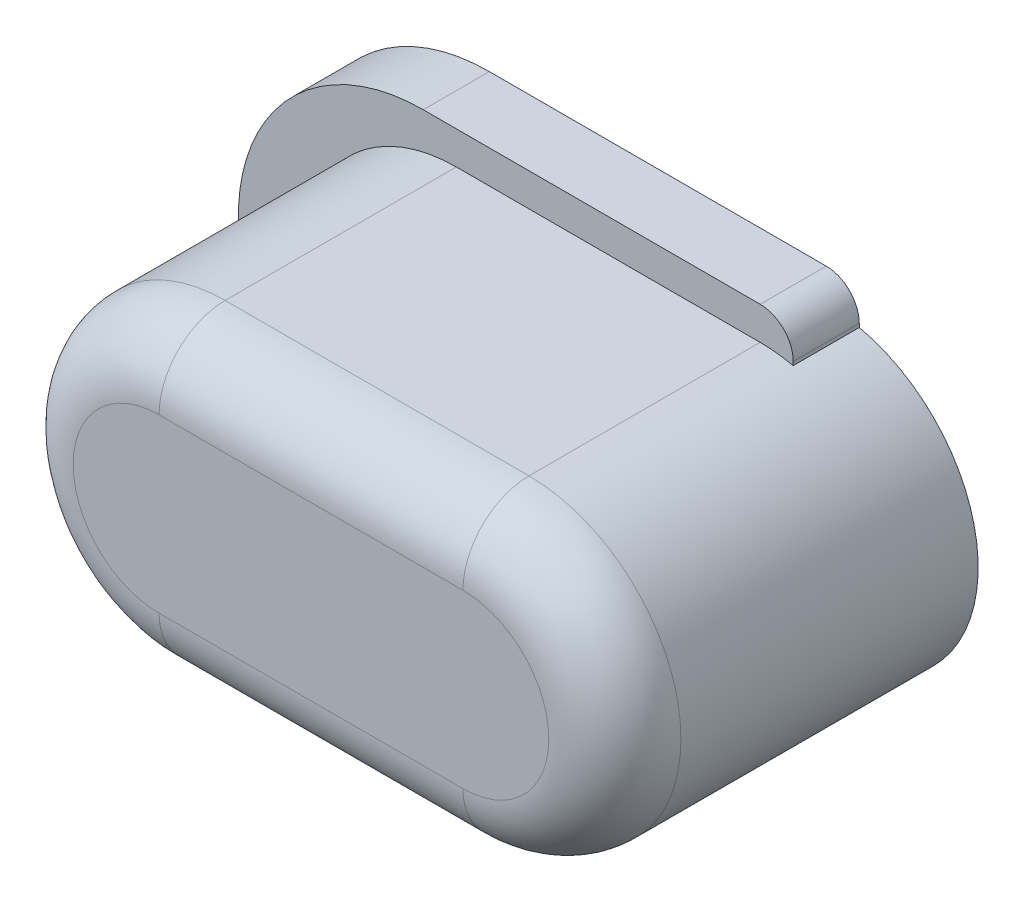
ISO-10303-21;
HEADER;
FILE_DESCRIPTION(('STEP AP214'),'2;1');
FILE_NAME('part.step','',(''),(''),'','','');
FILE_SCHEMA(('AUTOMOTIVE_DESIGN { 1 0 10303 214 1 1 1 1 }'));
ENDSEC;
DATA;
#1=APPLICATION_CONTEXT('core data for automotive mechanical design processes');
#2=APPLICATION_PROTOCOL_DEFINITION('international standard','automotive_design',2000,#1);
#3=PRODUCT_CONTEXT('',#1,'mechanical');
#4=PRODUCT('Part','Part','',(#3));
#5=PRODUCT_RELATED_PRODUCT_CATEGORY('part','',(#4));
#6=PRODUCT_DEFINITION_FORMATION('','',#4);
#7=PRODUCT_DEFINITION_CONTEXT('part definition',#1,'design');
#8=PRODUCT_DEFINITION('design','',#6,#7);
#9=PRODUCT_DEFINITION_SHAPE('','',#8);
#10=(LENGTH_UNIT() NAMED_UNIT(*) SI_UNIT(.MILLI.,.METRE.));
#11=(NAMED_UNIT(*) PLANE_ANGLE_UNIT() SI_UNIT($,.RADIAN.));
#12=(NAMED_UNIT(*) SI_UNIT($,.STERADIAN.) SOLID_ANGLE_UNIT());
#13=UNCERTAINTY_MEASURE_WITH_UNIT(LENGTH_MEASURE(1.E-05),#10,'distance_accuracy_value','');
#14=(GEOMETRIC_REPRESENTATION_CONTEXT(3) GLOBAL_UNCERTAINTY_ASSIGNED_CONTEXT((#13)) GLOBAL_UNIT_ASSIGNED_CONTEXT((#10,
#11,#12)) REPRESENTATION_CONTEXT('',''));
#15=CARTESIAN_POINT('',(0.,0.,0.));
#16=DIRECTION('',(0.,0.,1.));
#17=DIRECTION('',(1.,0.,0.));
#18=AXIS2_PLACEMENT_3D('',#15,#16,#17);
#19=CARTESIAN_POINT('',(2.3,2.3,5.5));
#20=DIRECTION('',(0.,-1.,0.));
#21=DIRECTION('',(1.,0.,0.));
#22=AXIS2_PLACEMENT_3D('',#19,#20,#21);
#23=PLANE('',#22);
#24=DIRECTION('',(0.,0.,-1.));
#25=VECTOR('',#24,1.);
#26=CARTESIAN_POINT('',(-2.3,2.3,5.5));
#27=LINE('',#26,#25);
#28=CARTESIAN_POINT('',(-2.3,2.3,4.5));
#29=VERTEX_POINT('',#28);
#30=CARTESIAN_POINT('',(-2.3,2.3,1.));
#31=VERTEX_POINT('',#30);
#32=EDGE_CURVE('E260',#29,#31,#27,.T.);
#33=ORIENTED_EDGE('',*,*,#32,.F.);
#34=DIRECTION('',(-1.,0.,0.));
#35=VECTOR('',#34,1.);
#36=CARTESIAN_POINT('',(2.3,2.3,4.5));
#37=LINE('',#36,#35);
#38=CARTESIAN_POINT('',(2.3,2.3,4.5));
#39=VERTEX_POINT('',#38);
#40=EDGE_CURVE('E11',#29,#39,#37,.F.);
#41=ORIENTED_EDGE('',*,*,#40,.T.);
#42=DIRECTION('',(0.,0.,-1.));
#43=VECTOR('',#42,1.);
#44=CARTESIAN_POINT('',(2.3,2.3,5.5));
#45=LINE('',#44,#43);
#46=CARTESIAN_POINT('',(2.3,2.3,1.));
#47=VERTEX_POINT('',#46);
#48=EDGE_CURVE('E263',#39,#47,#45,.T.);
#49=ORIENTED_EDGE('',*,*,#48,.T.);
#50=DIRECTION('',(1.,0.,0.));
#51=VECTOR('',#50,1.);
#52=CARTESIAN_POINT('',(2.3,2.3,1.));
#53=LINE('',#52,#51);
#54=EDGE_CURVE('E242',#31,#47,#53,.T.);
#55=ORIENTED_EDGE('',*,*,#54,.F.);
#56=EDGE_LOOP('',(#33,#41,#49,#55));
#57=FACE_BOUND('',#56,.T.);
#58=ADVANCED_FACE('F43',(#57),#23,.F.);
#59=CARTESIAN_POINT('',(-2.3,0.,5.5));
#60=DIRECTION('',(0.,0.,-1.));
#61=DIRECTION('',(-1.,0.,0.));
#62=AXIS2_PLACEMENT_3D('',#59,#60,#61);
#63=CYLINDRICAL_SURFACE('',#62,2.3);
#64=DIRECTION('',(0.,0.,-1.));
#65=VECTOR('',#64,1.);
#66=CARTESIAN_POINT('',(-2.3,-2.3,5.5));
#67=LINE('',#66,#65);
#68=CARTESIAN_POINT('',(-2.3,-2.3,4.5));
#69=VERTEX_POINT('',#68);
#70=CARTESIAN_POINT('',(-2.3,-2.3,1.));
#71=VERTEX_POINT('',#70);
#72=EDGE_CURVE('E257',#69,#71,#67,.T.);
#73=ORIENTED_EDGE('',*,*,#72,.F.);
#74=CARTESIAN_POINT('',(-2.3,0.,4.5));
#75=DIRECTION('',(0.,0.,1.));
#76=DIRECTION('',(1.,0.,0.));
#77=AXIS2_PLACEMENT_3D('',#74,#75,#76);
#78=CIRCLE('',#77,2.3);
#79=EDGE_CURVE('E53',#69,#29,#78,.F.);
#80=ORIENTED_EDGE('',*,*,#79,.T.);
#81=ORIENTED_EDGE('',*,*,#32,.T.);
#82=CARTESIAN_POINT('',(-2.3,0.,1.));
#83=DIRECTION('',(0.,0.,-1.));
#84=DIRECTION('',(-1.,0.,0.));
#85=AXIS2_PLACEMENT_3D('',#82,#83,#84);
#86=CIRCLE('',#85,2.3);
#87=EDGE_CURVE('E238',#71,#31,#86,.T.);
#88=ORIENTED_EDGE('',*,*,#87,.F.);
#89=EDGE_LOOP('',(#73,#80,#81,#88));
#90=FACE_BOUND('',#89,.T.);
#91=ADVANCED_FACE('F330',(#90),#63,.T.);
#92=CARTESIAN_POINT('',(2.3,-2.3,5.5));
#93=DIRECTION('',(0.,-1.,0.));
#94=DIRECTION('',(1.,0.,0.));
#95=AXIS2_PLACEMENT_3D('',#92,#93,#94);
#96=PLANE('',#95);
#97=DIRECTION('',(0.,0.,-1.));
#98=VECTOR('',#97,1.);
#99=CARTESIAN_POINT('',(2.3,-2.3,5.5));
#100=LINE('',#99,#98);
#101=CARTESIAN_POINT('',(2.3,-2.3,4.5));
#102=VERTEX_POINT('',#101);
#103=CARTESIAN_POINT('',(2.3,-2.3,1.));
#104=VERTEX_POINT('',#103);
#105=EDGE_CURVE('E254',#102,#104,#100,.T.);
#106=ORIENTED_EDGE('',*,*,#105,.F.);
#107=DIRECTION('',(-1.,0.,0.));
#108=VECTOR('',#107,1.);
#109=CARTESIAN_POINT('',(2.3,-2.3,4.5));
#110=LINE('',#109,#108);
#111=EDGE_CURVE('E68',#102,#69,#110,.T.);
#112=ORIENTED_EDGE('',*,*,#111,.T.);
#113=ORIENTED_EDGE('',*,*,#72,.T.);
#114=DIRECTION('',(1.,0.,0.));
#115=VECTOR('',#114,1.);
#116=CARTESIAN_POINT('',(2.3,-2.3,1.));
#117=LINE('',#116,#115);
#118=EDGE_CURVE('E266',#71,#104,#117,.T.);
#119=ORIENTED_EDGE('',*,*,#118,.T.);
#120=EDGE_LOOP('',(#106,#112,#113,#119));
#121=FACE_BOUND('',#120,.T.);
#122=ADVANCED_FACE('F336',(#121),#96,.T.);
#123=CARTESIAN_POINT('',(2.3,0.,5.5));
#124=DIRECTION('',(0.,0.,-1.));
#125=DIRECTION('',(-1.,0.,0.));
#126=AXIS2_PLACEMENT_3D('',#123,#124,#125);
#127=CYLINDRICAL_SURFACE('',#126,2.3);
#128=ORIENTED_EDGE('',*,*,#48,.F.);
#129=CARTESIAN_POINT('',(2.3,0.,4.5));
#130=DIRECTION('',(0.,0.,1.));
#131=DIRECTION('',(1.,0.,0.));
#132=AXIS2_PLACEMENT_3D('',#129,#130,#131);
#133=CIRCLE('',#132,2.3);
#134=EDGE_CURVE('E283',#39,#102,#133,.F.);
#135=ORIENTED_EDGE('',*,*,#134,.T.);
#136=ORIENTED_EDGE('',*,*,#105,.T.);
#137=CARTESIAN_POINT('',(2.3,0.,1.));
#138=DIRECTION('',(0.,0.,-1.));
#139=DIRECTION('',(-1.,0.,0.));
#140=AXIS2_PLACEMENT_3D('',#137,#138,#139);
#141=CIRCLE('',#140,2.3);
#142=CARTESIAN_POINT('',(2.8,-2.24499443206436,1.));
#143=VERTEX_POINT('',#142);
#144=EDGE_CURVE('E249',#143,#104,#141,.T.);
#145=ORIENTED_EDGE('',*,*,#144,.F.);
#146=DIRECTION('',(0.,0.,-1.));
#147=VECTOR('',#146,1.);
#148=CARTESIAN_POINT('',(2.8,-2.24499443206436,5.5));
#149=LINE('',#148,#147);
#150=CARTESIAN_POINT('',(2.8,-2.24499443206436,0.));
#151=VERTEX_POINT('',#150);
#152=EDGE_CURVE('E234',#143,#151,#149,.T.);
#153=ORIENTED_EDGE('',*,*,#152,.T.);
#154=CARTESIAN_POINT('',(2.3,0.,0.));
#155=DIRECTION('',(0.,0.,1.));
#156=DIRECTION('',(1.,0.,0.));
#157=AXIS2_PLACEMENT_3D('',#154,#155,#156);
#158=CIRCLE('',#157,2.3);
#159=CARTESIAN_POINT('',(2.8,2.24499443206437,0.));
#160=VERTEX_POINT('',#159);
#161=EDGE_CURVE('E250',#151,#160,#158,.T.);
#162=ORIENTED_EDGE('',*,*,#161,.T.);
#163=DIRECTION('',(0.,0.,-1.));
#164=VECTOR('',#163,1.);
#165=CARTESIAN_POINT('',(2.8,2.24499443206437,5.5));
#166=LINE('',#165,#164);
#167=CARTESIAN_POINT('',(2.8,2.24499443206437,1.));
#168=VERTEX_POINT('',#167);
#169=EDGE_CURVE('E217',#160,#168,#166,.F.);
#170=ORIENTED_EDGE('',*,*,#169,.T.);
#171=EDGE_CURVE('E246',#47,#168,#141,.T.);
#172=ORIENTED_EDGE('',*,*,#171,.F.);
#173=EDGE_LOOP('',(#128,#135,#136,#145,#153,#162,#170,#172));
#174=FACE_BOUND('',#173,.T.);
#175=ADVANCED_FACE('F340',(#174),#127,.T.);
#176=CARTESIAN_POINT('',(2.3,0.,5.5));
#177=DIRECTION('',(0.,0.,1.));
#178=DIRECTION('',(1.,0.,0.));
#179=AXIS2_PLACEMENT_3D('',#176,#177,#178);
#180=PLANE('',#179);
#181=DIRECTION('',(-1.,0.,0.));
#182=VECTOR('',#181,1.);
#183=CARTESIAN_POINT('',(2.3,-1.3,5.5));
#184=LINE('',#183,#182);
#185=CARTESIAN_POINT('',(-2.3,-1.3,5.5));
#186=VERTEX_POINT('',#185);
#187=CARTESIAN_POINT('',(2.3,-1.3,5.5));
#188=VERTEX_POINT('',#187);
#189=EDGE_CURVE('E276',#186,#188,#184,.F.);
#190=ORIENTED_EDGE('',*,*,#189,.T.);
#191=CARTESIAN_POINT('',(2.3,0.,5.5));
#192=DIRECTION('',(0.,0.,1.));
#193=DIRECTION('',(1.,0.,0.));
#194=AXIS2_PLACEMENT_3D('',#191,#192,#193);
#195=CIRCLE('',#194,1.3);
#196=CARTESIAN_POINT('',(2.3,1.3,5.5));
#197=VERTEX_POINT('',#196);
#198=EDGE_CURVE('E279',#188,#197,#195,.T.);
#199=ORIENTED_EDGE('',*,*,#198,.T.);
#200=DIRECTION('',(-1.,0.,0.));
#201=VECTOR('',#200,1.);
#202=CARTESIAN_POINT('',(-2.3,1.3,5.5));
#203=LINE('',#202,#201);
#204=CARTESIAN_POINT('',(-2.3,1.3,5.5));
#205=VERTEX_POINT('',#204);
#206=EDGE_CURVE('E270',#197,#205,#203,.T.);
#207=ORIENTED_EDGE('',*,*,#206,.T.);
#208=CARTESIAN_POINT('',(-2.3,0.,5.5));
#209=DIRECTION('',(0.,0.,1.));
#210=DIRECTION('',(1.,0.,0.));
#211=AXIS2_PLACEMENT_3D('',#208,#209,#210);
#212=CIRCLE('',#211,1.3);
#213=EDGE_CURVE('E273',#205,#186,#212,.T.);
#214=ORIENTED_EDGE('',*,*,#213,.T.);
#215=EDGE_LOOP('',(#190,#199,#207,#214));
#216=FACE_BOUND('',#215,.T.);
#217=ADVANCED_FACE('F343',(#216),#180,.T.);
#218=CARTESIAN_POINT('',(2.3,0.,0.));
#219=DIRECTION('',(0.,0.,1.));
#220=DIRECTION('',(1.,0.,0.));
#221=AXIS2_PLACEMENT_3D('',#218,#219,#220);
#222=PLANE('',#221);
#223=CARTESIAN_POINT('',(0.,0.,0.));
#224=DIRECTION('',(0.,0.,-1.));
#225=DIRECTION('',(-1.,0.,0.));
#226=AXIS2_PLACEMENT_3D('',#223,#224,#225);
#227=CIRCLE('',#226,2.);
#228=CARTESIAN_POINT('',(-2.,0.,0.));
#229=VERTEX_POINT('',#228);
#230=EDGE_CURVE('E181',#229,#229,#227,.T.);
#231=ORIENTED_EDGE('',*,*,#230,.F.);
#232=EDGE_LOOP('',(#231));
#233=FACE_BOUND('',#232,.T.);
#234=ORIENTED_EDGE('',*,*,#161,.F.);
#235=DIRECTION('',(0.,-1.,0.));
#236=VECTOR('',#235,1.);
#237=CARTESIAN_POINT('',(2.8,2.3,0.));
#238=LINE('',#237,#236);
#239=CARTESIAN_POINT('',(2.8,-2.3,0.));
#240=VERTEX_POINT('',#239);
#241=EDGE_CURVE('E207',#151,#240,#238,.T.);
#242=ORIENTED_EDGE('',*,*,#241,.T.);
#243=CARTESIAN_POINT('',(2.3,-2.3,0.));
#244=DIRECTION('',(0.,0.,1.));
#245=DIRECTION('',(1.,0.,0.));
#246=AXIS2_PLACEMENT_3D('',#243,#244,#245);
#247=CIRCLE('',#246,0.5);
#248=CARTESIAN_POINT('',(2.3,-2.8,0.));
#249=VERTEX_POINT('',#248);
#250=EDGE_CURVE('E178',#249,#240,#247,.T.);
#251=ORIENTED_EDGE('',*,*,#250,.F.);
#252=DIRECTION('',(1.,0.,0.));
#253=VECTOR('',#252,1.);
#254=CARTESIAN_POINT('',(-2.8,-2.8,0.));
#255=LINE('',#254,#253);
#256=CARTESIAN_POINT('',(-2.8,-2.8,0.));
#257=VERTEX_POINT('',#256);
#258=EDGE_CURVE('E175',#257,#249,#255,.T.);
#259=ORIENTED_EDGE('',*,*,#258,.F.);
#260=CARTESIAN_POINT('',(-2.8,0.,0.));
#261=DIRECTION('',(0.,0.,-1.));
#262=DIRECTION('',(-1.,0.,0.));
#263=AXIS2_PLACEMENT_3D('',#260,#261,#262);
#264=CIRCLE('',#263,2.8);
#265=CARTESIAN_POINT('',(-2.8,2.8,0.));
#266=VERTEX_POINT('',#265);
#267=EDGE_CURVE('E197',#257,#266,#264,.T.);
#268=ORIENTED_EDGE('',*,*,#267,.T.);
#269=DIRECTION('',(1.,0.,0.));
#270=VECTOR('',#269,1.);
#271=CARTESIAN_POINT('',(-2.8,2.8,0.));
#272=LINE('',#271,#270);
#273=CARTESIAN_POINT('',(2.3,2.8,0.));
#274=VERTEX_POINT('',#273);
#275=EDGE_CURVE('E151',#266,#274,#272,.T.);
#276=ORIENTED_EDGE('',*,*,#275,.T.);
#277=CARTESIAN_POINT('',(2.3,2.3,0.));
#278=DIRECTION('',(0.,0.,-1.));
#279=DIRECTION('',(-1.,0.,0.));
#280=AXIS2_PLACEMENT_3D('',#277,#278,#279);
#281=CIRCLE('',#280,0.5);
#282=CARTESIAN_POINT('',(2.8,2.3,0.));
#283=VERTEX_POINT('',#282);
#284=EDGE_CURVE('E203',#274,#283,#281,.T.);
#285=ORIENTED_EDGE('',*,*,#284,.T.);
#286=EDGE_CURVE('E208',#283,#160,#238,.T.);
#287=ORIENTED_EDGE('',*,*,#286,.T.);
#288=EDGE_LOOP('',(#234,#242,#251,#259,#268,#276,#285,#287));
#289=FACE_BOUND('',#288,.T.);
#290=ADVANCED_FACE('F369',(#233,#289),#222,.F.);
#291=CARTESIAN_POINT('',(-2.8,0.,1.));
#292=DIRECTION('',(0.,0.,-1.));
#293=DIRECTION('',(-1.,0.,0.));
#294=AXIS2_PLACEMENT_3D('',#291,#292,#293);
#295=PLANE('',#294);
#296=DIRECTION('',(0.,-1.,0.));
#297=VECTOR('',#296,1.);
#298=CARTESIAN_POINT('',(2.8,2.3,1.));
#299=LINE('',#298,#297);
#300=CARTESIAN_POINT('',(2.8,-2.3,1.));
#301=VERTEX_POINT('',#300);
#302=EDGE_CURVE('E186',#143,#301,#299,.T.);
#303=ORIENTED_EDGE('',*,*,#302,.F.);
#304=ORIENTED_EDGE('',*,*,#144,.T.);
#305=ORIENTED_EDGE('',*,*,#118,.F.);
#306=ORIENTED_EDGE('',*,*,#87,.T.);
#307=ORIENTED_EDGE('',*,*,#54,.T.);
#308=ORIENTED_EDGE('',*,*,#171,.T.);
#309=CARTESIAN_POINT('',(2.8,2.3,1.));
#310=VERTEX_POINT('',#309);
#311=EDGE_CURVE('E187',#310,#168,#299,.T.);
#312=ORIENTED_EDGE('',*,*,#311,.F.);
#313=CARTESIAN_POINT('',(2.3,2.3,1.));
#314=DIRECTION('',(0.,0.,-1.));
#315=DIRECTION('',(-1.,0.,0.));
#316=AXIS2_PLACEMENT_3D('',#313,#314,#315);
#317=CIRCLE('',#316,0.5);
#318=CARTESIAN_POINT('',(2.3,2.8,1.));
#319=VERTEX_POINT('',#318);
#320=EDGE_CURVE('E168',#319,#310,#317,.T.);
#321=ORIENTED_EDGE('',*,*,#320,.F.);
#322=DIRECTION('',(1.,0.,0.));
#323=VECTOR('',#322,1.);
#324=CARTESIAN_POINT('',(-2.8,2.8,1.));
#325=LINE('',#324,#323);
#326=CARTESIAN_POINT('',(-2.8,2.8,1.));
#327=VERTEX_POINT('',#326);
#328=EDGE_CURVE('E149',#327,#319,#325,.T.);
#329=ORIENTED_EDGE('',*,*,#328,.F.);
#330=CARTESIAN_POINT('',(-2.8,0.,1.));
#331=DIRECTION('',(0.,0.,-1.));
#332=DIRECTION('',(-1.,0.,0.));
#333=AXIS2_PLACEMENT_3D('',#330,#331,#332);
#334=CIRCLE('',#333,2.8);
#335=CARTESIAN_POINT('',(-2.8,-2.8,1.));
#336=VERTEX_POINT('',#335);
#337=EDGE_CURVE('E165',#336,#327,#334,.T.);
#338=ORIENTED_EDGE('',*,*,#337,.F.);
#339=DIRECTION('',(1.,0.,0.));
#340=VECTOR('',#339,1.);
#341=CARTESIAN_POINT('',(-2.8,-2.8,1.));
#342=LINE('',#341,#340);
#343=CARTESIAN_POINT('',(2.3,-2.8,1.));
#344=VERTEX_POINT('',#343);
#345=EDGE_CURVE('E158',#336,#344,#342,.T.);
#346=ORIENTED_EDGE('',*,*,#345,.T.);
#347=CARTESIAN_POINT('',(2.3,-2.3,1.));
#348=DIRECTION('',(0.,0.,1.));
#349=DIRECTION('',(1.,0.,0.));
#350=AXIS2_PLACEMENT_3D('',#347,#348,#349);
#351=CIRCLE('',#350,0.5);
#352=EDGE_CURVE('E191',#344,#301,#351,.T.);
#353=ORIENTED_EDGE('',*,*,#352,.T.);
#354=EDGE_LOOP('',(#303,#304,#305,#306,#307,#308,#312,#321,#329,#338,#346,#353));
#355=FACE_BOUND('',#354,.T.);
#356=ADVANCED_FACE('F164',(#355),#295,.F.);
#357=CARTESIAN_POINT('',(2.8,2.3,1.));
#358=DIRECTION('',(1.,0.,0.));
#359=DIRECTION('',(0.,0.,-1.));
#360=AXIS2_PLACEMENT_3D('',#357,#358,#359);
#361=PLANE('',#360);
#362=ORIENTED_EDGE('',*,*,#152,.F.);
#363=ORIENTED_EDGE('',*,*,#302,.T.);
#364=DIRECTION('',(0.,0.,-1.));
#365=VECTOR('',#364,1.);
#366=CARTESIAN_POINT('',(2.8,-2.3,1.));
#367=LINE('',#366,#365);
#368=EDGE_CURVE('E222',#301,#240,#367,.T.);
#369=ORIENTED_EDGE('',*,*,#368,.T.);
#370=ORIENTED_EDGE('',*,*,#241,.F.);
#371=EDGE_LOOP('',(#362,#363,#369,#370));
#372=FACE_BOUND('',#371,.T.);
#373=ADVANCED_FACE('F387',(#372),#361,.T.);
#374=ORIENTED_EDGE('',*,*,#169,.F.);
#375=ORIENTED_EDGE('',*,*,#286,.F.);
#376=DIRECTION('',(0.,0.,-1.));
#377=VECTOR('',#376,1.);
#378=CARTESIAN_POINT('',(2.8,2.3,1.));
#379=LINE('',#378,#377);
#380=EDGE_CURVE('E226',#310,#283,#379,.T.);
#381=ORIENTED_EDGE('',*,*,#380,.F.);
#382=ORIENTED_EDGE('',*,*,#311,.T.);
#383=EDGE_LOOP('',(#374,#375,#381,#382));
#384=FACE_BOUND('',#383,.T.);
#385=ADVANCED_FACE('F400',(#384),#361,.T.);
#386=CARTESIAN_POINT('',(-2.8,0.,1.));
#387=DIRECTION('',(0.,0.,-1.));
#388=DIRECTION('',(-1.,0.,0.));
#389=AXIS2_PLACEMENT_3D('',#386,#387,#388);
#390=CYLINDRICAL_SURFACE('',#389,2.8);
#391=ORIENTED_EDGE('',*,*,#267,.F.);
#392=DIRECTION('',(0.,0.,-1.));
#393=VECTOR('',#392,1.);
#394=CARTESIAN_POINT('',(-2.8,-2.8,1.));
#395=LINE('',#394,#393);
#396=EDGE_CURVE('E172',#336,#257,#395,.T.);
#397=ORIENTED_EDGE('',*,*,#396,.F.);
#398=ORIENTED_EDGE('',*,*,#337,.T.);
#399=DIRECTION('',(0.,0.,-1.));
#400=VECTOR('',#399,1.);
#401=CARTESIAN_POINT('',(-2.8,2.8,1.));
#402=LINE('',#401,#400);
#403=EDGE_CURVE('E146',#327,#266,#402,.T.);
#404=ORIENTED_EDGE('',*,*,#403,.T.);
#405=EDGE_LOOP('',(#391,#397,#398,#404));
#406=FACE_BOUND('',#405,.T.);
#407=ADVANCED_FACE('F171',(#406),#390,.T.);
#408=CARTESIAN_POINT('',(-2.8,-2.8,1.));
#409=DIRECTION('',(0.,1.,0.));
#410=DIRECTION('',(-1.,0.,0.));
#411=AXIS2_PLACEMENT_3D('',#408,#409,#410);
#412=PLANE('',#411);
#413=ORIENTED_EDGE('',*,*,#258,.T.);
#414=DIRECTION('',(0.,0.,-1.));
#415=VECTOR('',#414,1.);
#416=CARTESIAN_POINT('',(2.3,-2.8,1.));
#417=LINE('',#416,#415);
#418=EDGE_CURVE('E218',#344,#249,#417,.T.);
#419=ORIENTED_EDGE('',*,*,#418,.F.);
#420=ORIENTED_EDGE('',*,*,#345,.F.);
#421=ORIENTED_EDGE('',*,*,#396,.T.);
#422=EDGE_LOOP('',(#413,#419,#420,#421));
#423=FACE_BOUND('',#422,.T.);
#424=ADVANCED_FACE('F408',(#423),#412,.F.);
#425=CARTESIAN_POINT('',(2.3,-2.3,1.));
#426=DIRECTION('',(0.,0.,-1.));
#427=DIRECTION('',(-1.,0.,0.));
#428=AXIS2_PLACEMENT_3D('',#425,#426,#427);
#429=CYLINDRICAL_SURFACE('',#428,0.5);
#430=ORIENTED_EDGE('',*,*,#250,.T.);
#431=ORIENTED_EDGE('',*,*,#368,.F.);
#432=ORIENTED_EDGE('',*,*,#352,.F.);
#433=ORIENTED_EDGE('',*,*,#418,.T.);
#434=EDGE_LOOP('',(#430,#431,#432,#433));
#435=FACE_BOUND('',#434,.T.);
#436=ADVANCED_FACE('F392',(#435),#429,.T.);
#437=CARTESIAN_POINT('',(2.3,2.3,1.));
#438=DIRECTION('',(0.,0.,-1.));
#439=DIRECTION('',(-1.,0.,0.));
#440=AXIS2_PLACEMENT_3D('',#437,#438,#439);
#441=CYLINDRICAL_SURFACE('',#440,0.5);
#442=ORIENTED_EDGE('',*,*,#284,.F.);
#443=DIRECTION('',(0.,0.,-1.));
#444=VECTOR('',#443,1.);
#445=CARTESIAN_POINT('',(2.3,2.8,1.));
#446=LINE('',#445,#444);
#447=EDGE_CURVE('E157',#319,#274,#446,.T.);
#448=ORIENTED_EDGE('',*,*,#447,.F.);
#449=ORIENTED_EDGE('',*,*,#320,.T.);
#450=ORIENTED_EDGE('',*,*,#380,.T.);
#451=EDGE_LOOP('',(#442,#448,#449,#450));
#452=FACE_BOUND('',#451,.T.);
#453=ADVANCED_FACE('F326',(#452),#441,.T.);
#454=CARTESIAN_POINT('',(-2.8,2.8,1.));
#455=DIRECTION('',(0.,1.,0.));
#456=DIRECTION('',(-1.,0.,0.));
#457=AXIS2_PLACEMENT_3D('',#454,#455,#456);
#458=PLANE('',#457);
#459=ORIENTED_EDGE('',*,*,#275,.F.);
#460=ORIENTED_EDGE('',*,*,#403,.F.);
#461=ORIENTED_EDGE('',*,*,#328,.T.);
#462=ORIENTED_EDGE('',*,*,#447,.T.);
#463=EDGE_LOOP('',(#459,#460,#461,#462));
#464=FACE_BOUND('',#463,.T.);
#465=ADVANCED_FACE('F148',(#464),#458,.T.);
#466=CARTESIAN_POINT('',(0.,0.,0.5));
#467=DIRECTION('',(0.,0.,-1.));
#468=DIRECTION('',(-1.,0.,0.));
#469=AXIS2_PLACEMENT_3D('',#466,#467,#468);
#470=CYLINDRICAL_SURFACE('',#469,2.);
#471=CARTESIAN_POINT('',(0.,0.,0.5));
#472=DIRECTION('',(0.,0.,-1.));
#473=DIRECTION('',(-1.,0.,0.));
#474=AXIS2_PLACEMENT_3D('',#471,#472,#473);
#475=CIRCLE('',#474,2.);
#476=CARTESIAN_POINT('',(-2.,0.,0.5));
#477=VERTEX_POINT('',#476);
#478=EDGE_CURVE('E200',#477,#477,#475,.T.);
#479=ORIENTED_EDGE('',*,*,#478,.F.);
#480=EDGE_LOOP('',(#479));
#481=FACE_BOUND('',#480,.T.);
#482=ORIENTED_EDGE('',*,*,#230,.T.);
#483=EDGE_LOOP('',(#482));
#484=FACE_BOUND('',#483,.T.);
#485=ADVANCED_FACE('F318',(#481,#484),#470,.F.);
#486=CARTESIAN_POINT('',(0.,0.,0.5));
#487=DIRECTION('',(0.,0.,-1.));
#488=DIRECTION('',(-1.,0.,0.));
#489=AXIS2_PLACEMENT_3D('',#486,#487,#488);
#490=PLANE('',#489);
#491=ORIENTED_EDGE('',*,*,#478,.T.);
#492=EDGE_LOOP('',(#491));
#493=FACE_BOUND('',#492,.T.);
#494=ADVANCED_FACE('F316',(#493),#490,.T.);
#495=CARTESIAN_POINT('',(-2.3,0.,4.5));
#496=DIRECTION('',(0.,0.,1.));
#497=DIRECTION('',(1.,0.,0.));
#498=AXIS2_PLACEMENT_3D('',#495,#496,#497);
#499=TOROIDAL_SURFACE('',#498,1.3,1.);
#500=CARTESIAN_POINT('',(-2.3,1.3,4.5));
#501=DIRECTION('',(1.,0.,0.));
#502=DIRECTION('',(0.,0.,-1.));
#503=AXIS2_PLACEMENT_3D('',#500,#501,#502);
#504=CIRCLE('',#503,1.);
#505=EDGE_CURVE('E296',#29,#205,#504,.T.);
#506=ORIENTED_EDGE('',*,*,#505,.F.);
#507=ORIENTED_EDGE('',*,*,#79,.F.);
#508=CARTESIAN_POINT('',(-2.3,-1.3,4.5));
#509=DIRECTION('',(1.,0.,0.));
#510=DIRECTION('',(0.,0.,-1.));
#511=AXIS2_PLACEMENT_3D('',#508,#509,#510);
#512=CIRCLE('',#511,1.);
#513=EDGE_CURVE('E47',#186,#69,#512,.T.);
#514=ORIENTED_EDGE('',*,*,#513,.F.);
#515=ORIENTED_EDGE('',*,*,#213,.F.);
#516=EDGE_LOOP('',(#506,#507,#514,#515));
#517=FACE_BOUND('',#516,.T.);
#518=ADVANCED_FACE('F45',(#517),#499,.T.);
#519=CARTESIAN_POINT('',(2.3,-1.3,4.5));
#520=DIRECTION('',(-1.,0.,0.));
#521=DIRECTION('',(0.,-1.,0.));
#522=AXIS2_PLACEMENT_3D('',#519,#520,#521);
#523=CYLINDRICAL_SURFACE('',#522,1.);
#524=ORIENTED_EDGE('',*,*,#513,.T.);
#525=ORIENTED_EDGE('',*,*,#111,.F.);
#526=CARTESIAN_POINT('',(2.3,-1.3,4.5));
#527=DIRECTION('',(1.,0.,0.));
#528=DIRECTION('',(0.,0.,-1.));
#529=AXIS2_PLACEMENT_3D('',#526,#527,#528);
#530=CIRCLE('',#529,1.);
#531=EDGE_CURVE('E294',#188,#102,#530,.T.);
#532=ORIENTED_EDGE('',*,*,#531,.F.);
#533=ORIENTED_EDGE('',*,*,#189,.F.);
#534=EDGE_LOOP('',(#524,#525,#532,#533));
#535=FACE_BOUND('',#534,.T.);
#536=ADVANCED_FACE('F351',(#535),#523,.T.);
#537=CARTESIAN_POINT('',(2.3,1.3,4.5));
#538=DIRECTION('',(1.,0.,0.));
#539=DIRECTION('',(0.,1.,0.));
#540=AXIS2_PLACEMENT_3D('',#537,#538,#539);
#541=CYLINDRICAL_SURFACE('',#540,1.);
#542=ORIENTED_EDGE('',*,*,#505,.T.);
#543=ORIENTED_EDGE('',*,*,#206,.F.);
#544=CARTESIAN_POINT('',(2.3,1.3,4.5));
#545=DIRECTION('',(1.,0.,0.));
#546=DIRECTION('',(0.,0.,-1.));
#547=AXIS2_PLACEMENT_3D('',#544,#545,#546);
#548=CIRCLE('',#547,1.);
#549=EDGE_CURVE('E291',#39,#197,#548,.T.);
#550=ORIENTED_EDGE('',*,*,#549,.F.);
#551=ORIENTED_EDGE('',*,*,#40,.F.);
#552=EDGE_LOOP('',(#542,#543,#550,#551));
#553=FACE_BOUND('',#552,.T.);
#554=ADVANCED_FACE('F348',(#553),#541,.T.);
#555=CARTESIAN_POINT('',(2.3,0.,4.5));
#556=DIRECTION('',(0.,0.,1.));
#557=DIRECTION('',(1.,0.,0.));
#558=AXIS2_PLACEMENT_3D('',#555,#556,#557);
#559=TOROIDAL_SURFACE('',#558,1.3,1.);
#560=ORIENTED_EDGE('',*,*,#531,.T.);
#561=ORIENTED_EDGE('',*,*,#134,.F.);
#562=ORIENTED_EDGE('',*,*,#549,.T.);
#563=ORIENTED_EDGE('',*,*,#198,.F.);
#564=EDGE_LOOP('',(#560,#561,#562,#563));
#565=FACE_BOUND('',#564,.T.);
#566=ADVANCED_FACE('F345',(#565),#559,.T.);
#567=CLOSED_SHELL('',(#58,#91,#122,#175,#217,#290,#356,#373,#385,#407,#424,#436,#453,#465,#485,
#494,#518,#536,#554,#566));
#568=MANIFOLD_SOLID_BREP('B2',#567);
#569=ADVANCED_BREP_SHAPE_REPRESENTATION('',(#18,#568),#14);
#570=SHAPE_DEFINITION_REPRESENTATION(#9,#569);
ENDSEC;
END-ISO-10303-21;
